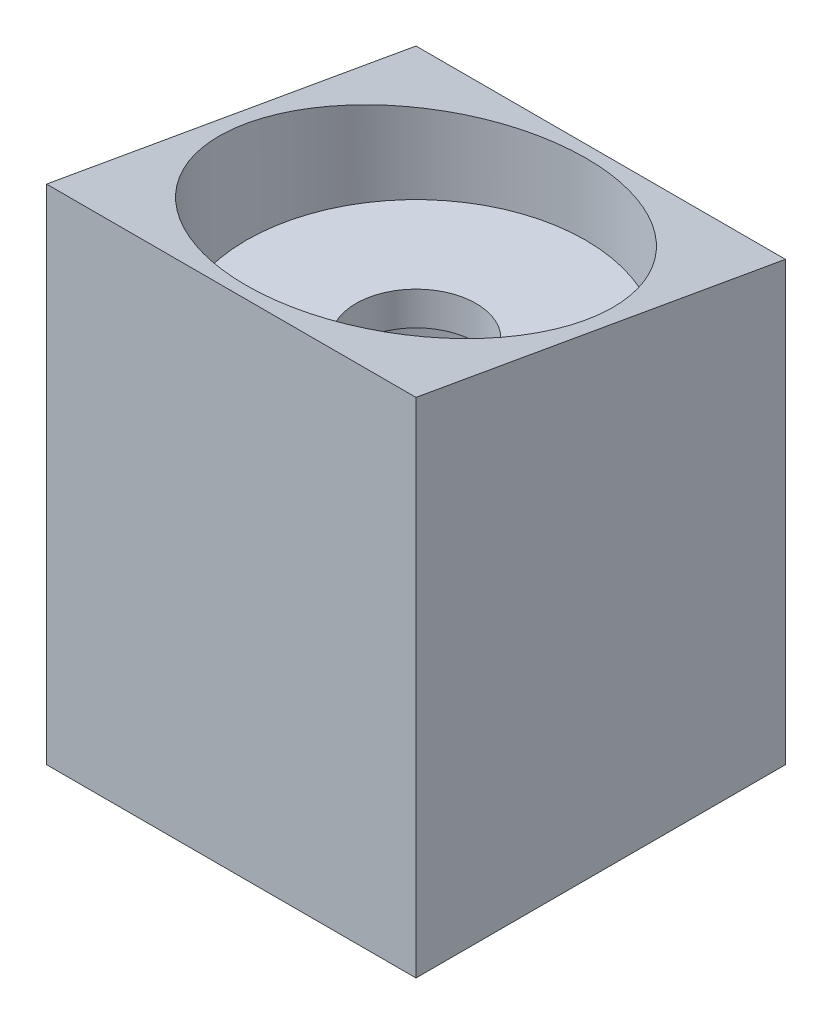
ISO-10303-21;
HEADER;
FILE_DESCRIPTION(('STEP AP214'),'2;1');
FILE_NAME('part.step','',(''),(''),'','','');
FILE_SCHEMA(('AUTOMOTIVE_DESIGN { 1 0 10303 214 1 1 1 1 }'));
ENDSEC;
DATA;
#1=APPLICATION_CONTEXT('core data for automotive mechanical design processes');
#2=APPLICATION_PROTOCOL_DEFINITION('international standard','automotive_design',2000,#1);
#3=PRODUCT_CONTEXT('',#1,'mechanical');
#4=PRODUCT('Part','Part','',(#3));
#5=PRODUCT_RELATED_PRODUCT_CATEGORY('part','',(#4));
#6=PRODUCT_DEFINITION_FORMATION('','',#4);
#7=PRODUCT_DEFINITION_CONTEXT('part definition',#1,'design');
#8=PRODUCT_DEFINITION('design','',#6,#7);
#9=PRODUCT_DEFINITION_SHAPE('','',#8);
#10=(LENGTH_UNIT() NAMED_UNIT(*) SI_UNIT(.MILLI.,.METRE.));
#11=(NAMED_UNIT(*) PLANE_ANGLE_UNIT() SI_UNIT($,.RADIAN.));
#12=(NAMED_UNIT(*) SI_UNIT($,.STERADIAN.) SOLID_ANGLE_UNIT());
#13=UNCERTAINTY_MEASURE_WITH_UNIT(LENGTH_MEASURE(1.E-05),#10,'distance_accuracy_value','');
#14=(GEOMETRIC_REPRESENTATION_CONTEXT(3) GLOBAL_UNCERTAINTY_ASSIGNED_CONTEXT((#13)) GLOBAL_UNIT_ASSIGNED_CONTEXT((#10,
#11,#12)) REPRESENTATION_CONTEXT('',''));
#15=CARTESIAN_POINT('',(0.,0.,0.));
#16=DIRECTION('',(0.,0.,1.));
#17=DIRECTION('',(1.,0.,0.));
#18=AXIS2_PLACEMENT_3D('',#15,#16,#17);
#19=CARTESIAN_POINT('',(11.,-20.,-11.));
#20=DIRECTION('',(1.,0.,0.));
#21=DIRECTION('',(0.,0.,-1.));
#22=AXIS2_PLACEMENT_3D('',#19,#20,#21);
#23=PLANE('',#22);
#24=DIRECTION('',(0.,1.,0.));
#25=VECTOR('',#24,1.);
#26=CARTESIAN_POINT('',(11.,-20.,-11.));
#27=LINE('',#26,#25);
#28=CARTESIAN_POINT('',(11.,-20.,-11.));
#29=VERTEX_POINT('',#28);
#30=CARTESIAN_POINT('',(11.,6.06291723,-11.));
#31=VERTEX_POINT('',#30);
#32=EDGE_CURVE('E105',#29,#31,#27,.T.);
#33=ORIENTED_EDGE('',*,*,#32,.T.);
#34=DIRECTION('',(0.,0.173648177666931,0.984807753012208));
#35=VECTOR('',#34,1.);
#36=CARTESIAN_POINT('',(11.,6.06291723,-11.));
#37=LINE('',#36,#35);
#38=CARTESIAN_POINT('',(11.,9.94211080558623,11.));
#39=VERTEX_POINT('',#38);
#40=EDGE_CURVE('E61',#31,#39,#37,.T.);
#41=ORIENTED_EDGE('',*,*,#40,.T.);
#42=DIRECTION('',(0.,1.,0.));
#43=VECTOR('',#42,1.);
#44=CARTESIAN_POINT('',(11.,-20.,11.));
#45=LINE('',#44,#43);
#46=CARTESIAN_POINT('',(11.,-20.,11.));
#47=VERTEX_POINT('',#46);
#48=EDGE_CURVE('E12',#47,#39,#45,.T.);
#49=ORIENTED_EDGE('',*,*,#48,.F.);
#50=DIRECTION('',(0.,0.,-1.));
#51=VECTOR('',#50,1.);
#52=CARTESIAN_POINT('',(11.,-20.,-11.));
#53=LINE('',#52,#51);
#54=EDGE_CURVE('E115',#47,#29,#53,.T.);
#55=ORIENTED_EDGE('',*,*,#54,.T.);
#56=EDGE_LOOP('',(#33,#41,#49,#55));
#57=FACE_BOUND('',#56,.T.);
#58=ADVANCED_FACE('F45',(#57),#23,.T.);
#59=CARTESIAN_POINT('',(-11.,-20.,11.));
#60=DIRECTION('',(0.,0.,1.));
#61=DIRECTION('',(1.,0.,0.));
#62=AXIS2_PLACEMENT_3D('',#59,#60,#61);
#63=PLANE('',#62);
#64=ORIENTED_EDGE('',*,*,#48,.T.);
#65=DIRECTION('',(1.,0.,0.));
#66=VECTOR('',#65,1.);
#67=CARTESIAN_POINT('',(-11.,9.94211080558623,11.));
#68=LINE('',#67,#66);
#69=CARTESIAN_POINT('',(-11.,9.94211080558623,11.));
#70=VERTEX_POINT('',#69);
#71=EDGE_CURVE('E88',#70,#39,#68,.T.);
#72=ORIENTED_EDGE('',*,*,#71,.F.);
#73=DIRECTION('',(0.,1.,0.));
#74=VECTOR('',#73,1.);
#75=CARTESIAN_POINT('',(-11.,-20.,11.));
#76=LINE('',#75,#74);
#77=CARTESIAN_POINT('',(-11.,-20.,11.));
#78=VERTEX_POINT('',#77);
#79=EDGE_CURVE('E53',#78,#70,#76,.T.);
#80=ORIENTED_EDGE('',*,*,#79,.F.);
#81=DIRECTION('',(1.,0.,0.));
#82=VECTOR('',#81,1.);
#83=CARTESIAN_POINT('',(-11.,-20.,11.));
#84=LINE('',#83,#82);
#85=EDGE_CURVE('E109',#78,#47,#84,.T.);
#86=ORIENTED_EDGE('',*,*,#85,.T.);
#87=EDGE_LOOP('',(#64,#72,#80,#86));
#88=FACE_BOUND('',#87,.T.);
#89=ADVANCED_FACE('F95',(#88),#63,.T.);
#90=CARTESIAN_POINT('',(-11.,-20.,-11.));
#91=DIRECTION('',(-1.,0.,0.));
#92=DIRECTION('',(0.,0.,1.));
#93=AXIS2_PLACEMENT_3D('',#90,#91,#92);
#94=PLANE('',#93);
#95=ORIENTED_EDGE('',*,*,#79,.T.);
#96=DIRECTION('',(0.,0.173648177666931,0.984807753012208));
#97=VECTOR('',#96,1.);
#98=CARTESIAN_POINT('',(-11.,6.06291723,-11.));
#99=LINE('',#98,#97);
#100=CARTESIAN_POINT('',(-11.,6.06291723,-11.));
#101=VERTEX_POINT('',#100);
#102=EDGE_CURVE('E84',#101,#70,#99,.T.);
#103=ORIENTED_EDGE('',*,*,#102,.F.);
#104=DIRECTION('',(0.,1.,0.));
#105=VECTOR('',#104,1.);
#106=CARTESIAN_POINT('',(-11.,-20.,-11.));
#107=LINE('',#106,#105);
#108=CARTESIAN_POINT('',(-11.,-20.,-11.));
#109=VERTEX_POINT('',#108);
#110=EDGE_CURVE('E103',#109,#101,#107,.T.);
#111=ORIENTED_EDGE('',*,*,#110,.F.);
#112=DIRECTION('',(0.,0.,1.));
#113=VECTOR('',#112,1.);
#114=CARTESIAN_POINT('',(-11.,-20.,-11.));
#115=LINE('',#114,#113);
#116=EDGE_CURVE('E101',#109,#78,#115,.T.);
#117=ORIENTED_EDGE('',*,*,#116,.T.);
#118=EDGE_LOOP('',(#95,#103,#111,#117));
#119=FACE_BOUND('',#118,.T.);
#120=ADVANCED_FACE('F99',(#119),#94,.T.);
#121=CARTESIAN_POINT('',(-11.,-20.,-11.));
#122=DIRECTION('',(0.,0.,-1.));
#123=DIRECTION('',(-1.,0.,0.));
#124=AXIS2_PLACEMENT_3D('',#121,#122,#123);
#125=PLANE('',#124);
#126=ORIENTED_EDGE('',*,*,#110,.T.);
#127=DIRECTION('',(1.,0.,0.));
#128=VECTOR('',#127,1.);
#129=CARTESIAN_POINT('',(-11.,6.06291723,-11.));
#130=LINE('',#129,#128);
#131=EDGE_CURVE('E89',#101,#31,#130,.T.);
#132=ORIENTED_EDGE('',*,*,#131,.T.);
#133=ORIENTED_EDGE('',*,*,#32,.F.);
#134=DIRECTION('',(-1.,0.,0.));
#135=VECTOR('',#134,1.);
#136=CARTESIAN_POINT('',(-11.,-20.,-11.));
#137=LINE('',#136,#135);
#138=EDGE_CURVE('E110',#29,#109,#137,.T.);
#139=ORIENTED_EDGE('',*,*,#138,.T.);
#140=EDGE_LOOP('',(#126,#132,#133,#139));
#141=FACE_BOUND('',#140,.T.);
#142=ADVANCED_FACE('F153',(#141),#125,.T.);
#143=CARTESIAN_POINT('',(0.,-20.,0.));
#144=DIRECTION('',(0.,1.,0.));
#145=DIRECTION('',(0.,0.,1.));
#146=AXIS2_PLACEMENT_3D('',#143,#144,#145);
#147=CYLINDRICAL_SURFACE('',#146,10.125);
#148=CARTESIAN_POINT('',(0.,-20.,0.));
#149=DIRECTION('',(0.,1.,0.));
#150=DIRECTION('',(0.,0.,1.));
#151=AXIS2_PLACEMENT_3D('',#148,#149,#150);
#152=CIRCLE('',#151,10.125);
#153=CARTESIAN_POINT('',(0.,-20.,10.125));
#154=VERTEX_POINT('',#153);
#155=EDGE_CURVE('E117',#154,#154,#152,.T.);
#156=ORIENTED_EDGE('',*,*,#155,.F.);
#157=EDGE_LOOP('',(#156));
#158=FACE_BOUND('',#157,.T.);
#159=CARTESIAN_POINT('',(0.,8.00251401779312,0.));
#160=DIRECTION('',(0.,0.984807753012208,-0.173648177666931));
#161=DIRECTION('',(0.,0.173648177666931,0.984807753012208));
#162=AXIS2_PLACEMENT_3D('',#159,#160,#161);
#163=ELLIPSE('',#162,10.2811944453432,10.125);
#164=CARTESIAN_POINT('',(0.,9.78782469746633,10.125));
#165=VERTEX_POINT('',#164);
#166=EDGE_CURVE('E48',#165,#165,#163,.F.);
#167=ORIENTED_EDGE('',*,*,#166,.F.);
#168=EDGE_LOOP('',(#167));
#169=FACE_BOUND('',#168,.T.);
#170=ADVANCED_FACE('F159',(#158,#169),#147,.F.);
#171=CARTESIAN_POINT('',(0.,-20.,0.));
#172=DIRECTION('',(0.,1.,0.));
#173=DIRECTION('',(0.,0.,1.));
#174=AXIS2_PLACEMENT_3D('',#171,#172,#173);
#175=PLANE('',#174);
#176=CARTESIAN_POINT('',(9.25,-20.,9.));
#177=DIRECTION('',(0.,-1.,0.));
#178=DIRECTION('',(0.,0.,1.));
#179=AXIS2_PLACEMENT_3D('',#176,#177,#178);
#180=CIRCLE('',#179,0.985);
#181=CARTESIAN_POINT('',(9.25,-20.,9.985));
#182=VERTEX_POINT('',#181);
#183=EDGE_CURVE('E130',#182,#182,#180,.T.);
#184=ORIENTED_EDGE('',*,*,#183,.F.);
#185=EDGE_LOOP('',(#184));
#186=FACE_BOUND('',#185,.T.);
#187=CARTESIAN_POINT('',(9.24999999999999,-20.,-9.));
#188=DIRECTION('',(0.,-1.,0.));
#189=DIRECTION('',(0.,0.,-1.));
#190=AXIS2_PLACEMENT_3D('',#187,#188,#189);
#191=CIRCLE('',#190,0.985);
#192=CARTESIAN_POINT('',(9.24999999999999,-20.,-9.985));
#193=VERTEX_POINT('',#192);
#194=EDGE_CURVE('E136',#193,#193,#191,.T.);
#195=ORIENTED_EDGE('',*,*,#194,.F.);
#196=EDGE_LOOP('',(#195));
#197=FACE_BOUND('',#196,.T.);
#198=CARTESIAN_POINT('',(-9.25,-20.,-9.));
#199=DIRECTION('',(0.,-1.,0.));
#200=DIRECTION('',(0.,0.,1.));
#201=AXIS2_PLACEMENT_3D('',#198,#199,#200);
#202=CIRCLE('',#201,0.985);
#203=CARTESIAN_POINT('',(-9.25,-20.,-8.015));
#204=VERTEX_POINT('',#203);
#205=EDGE_CURVE('E124',#204,#204,#202,.T.);
#206=ORIENTED_EDGE('',*,*,#205,.F.);
#207=EDGE_LOOP('',(#206));
#208=FACE_BOUND('',#207,.T.);
#209=CARTESIAN_POINT('',(-9.25,-20.,9.));
#210=DIRECTION('',(0.,-1.,0.));
#211=DIRECTION('',(0.,0.,-1.));
#212=AXIS2_PLACEMENT_3D('',#209,#210,#211);
#213=CIRCLE('',#212,0.985);
#214=CARTESIAN_POINT('',(-9.25,-20.,8.015));
#215=VERTEX_POINT('',#214);
#216=EDGE_CURVE('E121',#215,#215,#213,.T.);
#217=ORIENTED_EDGE('',*,*,#216,.F.);
#218=EDGE_LOOP('',(#217));
#219=FACE_BOUND('',#218,.T.);
#220=ORIENTED_EDGE('',*,*,#155,.T.);
#221=EDGE_LOOP('',(#220));
#222=FACE_BOUND('',#221,.T.);
#223=ORIENTED_EDGE('',*,*,#54,.F.);
#224=ORIENTED_EDGE('',*,*,#85,.F.);
#225=ORIENTED_EDGE('',*,*,#116,.F.);
#226=ORIENTED_EDGE('',*,*,#138,.F.);
#227=EDGE_LOOP('',(#223,#224,#225,#226));
#228=FACE_BOUND('',#227,.T.);
#229=ADVANCED_FACE('F156',(#186,#197,#208,#219,#222,#228),#175,.F.);
#230=CARTESIAN_POINT('',(-9.25,-14.,9.));
#231=DIRECTION('',(0.,-1.,0.));
#232=DIRECTION('',(0.,0.,-1.));
#233=AXIS2_PLACEMENT_3D('',#230,#231,#232);
#234=CYLINDRICAL_SURFACE('',#233,0.985);
#235=CARTESIAN_POINT('',(-9.25,-14.,9.));
#236=DIRECTION('',(0.,-1.,0.));
#237=DIRECTION('',(0.,0.,-1.));
#238=AXIS2_PLACEMENT_3D('',#235,#236,#237);
#239=CIRCLE('',#238,0.985);
#240=CARTESIAN_POINT('',(-9.25,-14.,8.015));
#241=VERTEX_POINT('',#240);
#242=EDGE_CURVE('E120',#241,#241,#239,.T.);
#243=ORIENTED_EDGE('',*,*,#242,.F.);
#244=EDGE_LOOP('',(#243));
#245=FACE_BOUND('',#244,.T.);
#246=ORIENTED_EDGE('',*,*,#216,.T.);
#247=EDGE_LOOP('',(#246));
#248=FACE_BOUND('',#247,.T.);
#249=ADVANCED_FACE('F168',(#245,#248),#234,.F.);
#250=CARTESIAN_POINT('',(-9.25,-14.,9.));
#251=DIRECTION('',(0.,-1.,0.));
#252=DIRECTION('',(0.,0.,-1.));
#253=AXIS2_PLACEMENT_3D('',#250,#251,#252);
#254=PLANE('',#253);
#255=ORIENTED_EDGE('',*,*,#242,.T.);
#256=EDGE_LOOP('',(#255));
#257=FACE_BOUND('',#256,.T.);
#258=ADVANCED_FACE('F173',(#257),#254,.T.);
#259=CARTESIAN_POINT('',(-9.25,-14.,-9.));
#260=DIRECTION('',(0.,-1.,0.));
#261=DIRECTION('',(0.,0.,-1.));
#262=AXIS2_PLACEMENT_3D('',#259,#260,#261);
#263=CYLINDRICAL_SURFACE('',#262,0.985);
#264=CARTESIAN_POINT('',(-9.25,-14.,-9.));
#265=DIRECTION('',(0.,-1.,0.));
#266=DIRECTION('',(0.,0.,1.));
#267=AXIS2_PLACEMENT_3D('',#264,#265,#266);
#268=CIRCLE('',#267,0.985);
#269=CARTESIAN_POINT('',(-9.25,-14.,-8.015));
#270=VERTEX_POINT('',#269);
#271=EDGE_CURVE('E139',#270,#270,#268,.T.);
#272=ORIENTED_EDGE('',*,*,#271,.F.);
#273=EDGE_LOOP('',(#272));
#274=FACE_BOUND('',#273,.T.);
#275=ORIENTED_EDGE('',*,*,#205,.T.);
#276=EDGE_LOOP('',(#275));
#277=FACE_BOUND('',#276,.T.);
#278=ADVANCED_FACE('F198',(#274,#277),#263,.F.);
#279=CARTESIAN_POINT('',(-9.25,-14.,-9.));
#280=DIRECTION('',(0.,1.,0.));
#281=DIRECTION('',(0.,0.,1.));
#282=AXIS2_PLACEMENT_3D('',#279,#280,#281);
#283=PLANE('',#282);
#284=ORIENTED_EDGE('',*,*,#271,.T.);
#285=EDGE_LOOP('',(#284));
#286=FACE_BOUND('',#285,.T.);
#287=ADVANCED_FACE('F201',(#286),#283,.F.);
#288=CARTESIAN_POINT('',(9.24999999999999,-14.,-9.));
#289=DIRECTION('',(0.,-1.,0.));
#290=DIRECTION('',(0.,0.,-1.));
#291=AXIS2_PLACEMENT_3D('',#288,#289,#290);
#292=CYLINDRICAL_SURFACE('',#291,0.985);
#293=CARTESIAN_POINT('',(9.24999999999999,-14.,-9.));
#294=DIRECTION('',(0.,-1.,0.));
#295=DIRECTION('',(0.,0.,-1.));
#296=AXIS2_PLACEMENT_3D('',#293,#294,#295);
#297=CIRCLE('',#296,0.985);
#298=CARTESIAN_POINT('',(9.24999999999999,-14.,-9.985));
#299=VERTEX_POINT('',#298);
#300=EDGE_CURVE('E133',#299,#299,#297,.T.);
#301=ORIENTED_EDGE('',*,*,#300,.F.);
#302=EDGE_LOOP('',(#301));
#303=FACE_BOUND('',#302,.T.);
#304=ORIENTED_EDGE('',*,*,#194,.T.);
#305=EDGE_LOOP('',(#304));
#306=FACE_BOUND('',#305,.T.);
#307=ADVANCED_FACE('F205',(#303,#306),#292,.F.);
#308=CARTESIAN_POINT('',(9.24999999999999,-14.,-9.));
#309=DIRECTION('',(0.,-1.,0.));
#310=DIRECTION('',(0.,0.,-1.));
#311=AXIS2_PLACEMENT_3D('',#308,#309,#310);
#312=PLANE('',#311);
#313=ORIENTED_EDGE('',*,*,#300,.T.);
#314=EDGE_LOOP('',(#313));
#315=FACE_BOUND('',#314,.T.);
#316=ADVANCED_FACE('F209',(#315),#312,.T.);
#317=CARTESIAN_POINT('',(9.25,-14.,9.));
#318=DIRECTION('',(0.,-1.,0.));
#319=DIRECTION('',(0.,0.,-1.));
#320=AXIS2_PLACEMENT_3D('',#317,#318,#319);
#321=CYLINDRICAL_SURFACE('',#320,0.985);
#322=CARTESIAN_POINT('',(9.25,-14.,9.));
#323=DIRECTION('',(0.,-1.,0.));
#324=DIRECTION('',(0.,0.,1.));
#325=AXIS2_PLACEMENT_3D('',#322,#323,#324);
#326=CIRCLE('',#325,0.985);
#327=CARTESIAN_POINT('',(9.25,-14.,9.985));
#328=VERTEX_POINT('',#327);
#329=EDGE_CURVE('E127',#328,#328,#326,.T.);
#330=ORIENTED_EDGE('',*,*,#329,.F.);
#331=EDGE_LOOP('',(#330));
#332=FACE_BOUND('',#331,.T.);
#333=ORIENTED_EDGE('',*,*,#183,.T.);
#334=EDGE_LOOP('',(#333));
#335=FACE_BOUND('',#334,.T.);
#336=ADVANCED_FACE('F194',(#332,#335),#321,.F.);
#337=CARTESIAN_POINT('',(9.25,-14.,9.));
#338=DIRECTION('',(0.,1.,0.));
#339=DIRECTION('',(0.,0.,1.));
#340=AXIS2_PLACEMENT_3D('',#337,#338,#339);
#341=PLANE('',#340);
#342=ORIENTED_EDGE('',*,*,#329,.T.);
#343=EDGE_LOOP('',(#342));
#344=FACE_BOUND('',#343,.T.);
#345=ADVANCED_FACE('F189',(#344),#341,.F.);
#346=CARTESIAN_POINT('',(-11.,6.06291723,-11.));
#347=DIRECTION('',(0.,0.984807753012208,-0.173648177666931));
#348=DIRECTION('',(0.,0.173648177666931,0.984807753012208));
#349=AXIS2_PLACEMENT_3D('',#346,#347,#348);
#350=PLANE('',#349);
#351=ORIENTED_EDGE('',*,*,#40,.F.);
#352=ORIENTED_EDGE('',*,*,#131,.F.);
#353=ORIENTED_EDGE('',*,*,#102,.T.);
#354=ORIENTED_EDGE('',*,*,#71,.T.);
#355=EDGE_LOOP('',(#351,#352,#353,#354));
#356=FACE_BOUND('',#355,.T.);
#357=ORIENTED_EDGE('',*,*,#166,.T.);
#358=EDGE_LOOP('',(#357));
#359=FACE_BOUND('',#358,.T.);
#360=ADVANCED_FACE('F86',(#356,#359),#350,.T.);
#361=CLOSED_SHELL('',(#58,#89,#120,#142,#170,#229,#249,#258,#278,#287,#307,#316,#336,#345,#360));
#362=MANIFOLD_SOLID_BREP('B2',#361);
#363=CARTESIAN_POINT('',(0.,2.,0.));
#364=DIRECTION('',(0.,1.,0.));
#365=DIRECTION('',(0.,0.,1.));
#366=AXIS2_PLACEMENT_3D('',#363,#364,#365);
#367=PLANE('',#366);
#368=CARTESIAN_POINT('',(0.,2.,0.));
#369=DIRECTION('',(0.,1.,0.));
#370=DIRECTION('',(0.,0.,1.));
#371=AXIS2_PLACEMENT_3D('',#368,#369,#370);
#372=CIRCLE('',#371,10.1);
#373=CARTESIAN_POINT('',(0.,2.,10.1));
#374=VERTEX_POINT('',#373);
#375=EDGE_CURVE('E44',#374,#374,#372,.T.);
#376=ORIENTED_EDGE('',*,*,#375,.T.);
#377=EDGE_LOOP('',(#376));
#378=FACE_BOUND('',#377,.T.);
#379=CARTESIAN_POINT('',(0.,2.,0.));
#380=DIRECTION('',(0.,1.,0.));
#381=DIRECTION('',(0.,0.,1.));
#382=AXIS2_PLACEMENT_3D('',#379,#380,#381);
#383=CIRCLE('',#382,3.575);
#384=CARTESIAN_POINT('',(0.,2.,3.575));
#385=VERTEX_POINT('',#384);
#386=EDGE_CURVE('E351',#385,#385,#383,.T.);
#387=ORIENTED_EDGE('',*,*,#386,.F.);
#388=EDGE_LOOP('',(#387));
#389=FACE_BOUND('',#388,.T.);
#390=ADVANCED_FACE('F340',(#378,#389),#367,.T.);
#391=CARTESIAN_POINT('',(0.,0.,0.));
#392=DIRECTION('',(0.,1.,0.));
#393=DIRECTION('',(0.,0.,1.));
#394=AXIS2_PLACEMENT_3D('',#391,#392,#393);
#395=PLANE('',#394);
#396=CARTESIAN_POINT('',(0.,0.,0.));
#397=DIRECTION('',(0.,1.,0.));
#398=DIRECTION('',(0.,0.,1.));
#399=AXIS2_PLACEMENT_3D('',#396,#397,#398);
#400=CIRCLE('',#399,10.1);
#401=CARTESIAN_POINT('',(0.,0.,10.1));
#402=VERTEX_POINT('',#401);
#403=EDGE_CURVE('E344',#402,#402,#400,.T.);
#404=ORIENTED_EDGE('',*,*,#403,.F.);
#405=EDGE_LOOP('',(#404));
#406=FACE_BOUND('',#405,.T.);
#407=CARTESIAN_POINT('',(0.,0.,0.));
#408=DIRECTION('',(0.,1.,0.));
#409=DIRECTION('',(0.,0.,1.));
#410=AXIS2_PLACEMENT_3D('',#407,#408,#409);
#411=CIRCLE('',#410,3.575);
#412=CARTESIAN_POINT('',(0.,0.,3.575));
#413=VERTEX_POINT('',#412);
#414=EDGE_CURVE('E353',#413,#413,#411,.T.);
#415=ORIENTED_EDGE('',*,*,#414,.T.);
#416=EDGE_LOOP('',(#415));
#417=FACE_BOUND('',#416,.T.);
#418=ADVANCED_FACE('F363',(#406,#417),#395,.F.);
#419=CARTESIAN_POINT('',(0.,2.,0.));
#420=DIRECTION('',(0.,-1.,0.));
#421=DIRECTION('',(0.,0.,-1.));
#422=AXIS2_PLACEMENT_3D('',#419,#420,#421);
#423=CYLINDRICAL_SURFACE('',#422,10.1);
#424=ORIENTED_EDGE('',*,*,#375,.F.);
#425=EDGE_LOOP('',(#424));
#426=FACE_BOUND('',#425,.T.);
#427=ORIENTED_EDGE('',*,*,#403,.T.);
#428=EDGE_LOOP('',(#427));
#429=FACE_BOUND('',#428,.T.);
#430=ADVANCED_FACE('F342',(#426,#429),#423,.T.);
#431=CARTESIAN_POINT('',(0.,2.,0.));
#432=DIRECTION('',(0.,-1.,0.));
#433=DIRECTION('',(0.,0.,-1.));
#434=AXIS2_PLACEMENT_3D('',#431,#432,#433);
#435=CYLINDRICAL_SURFACE('',#434,3.575);
#436=ORIENTED_EDGE('',*,*,#386,.T.);
#437=EDGE_LOOP('',(#436));
#438=FACE_BOUND('',#437,.T.);
#439=ORIENTED_EDGE('',*,*,#414,.F.);
#440=EDGE_LOOP('',(#439));
#441=FACE_BOUND('',#440,.T.);
#442=ADVANCED_FACE('F359',(#438,#441),#435,.F.);
#443=CLOSED_SHELL('',(#390,#418,#430,#442));
#444=MANIFOLD_SOLID_BREP('B6',#443);
#445=ADVANCED_BREP_SHAPE_REPRESENTATION('',(#18,#362,#444),#14);
#446=SHAPE_DEFINITION_REPRESENTATION(#9,#445);
ENDSEC;
END-ISO-10303-21;
